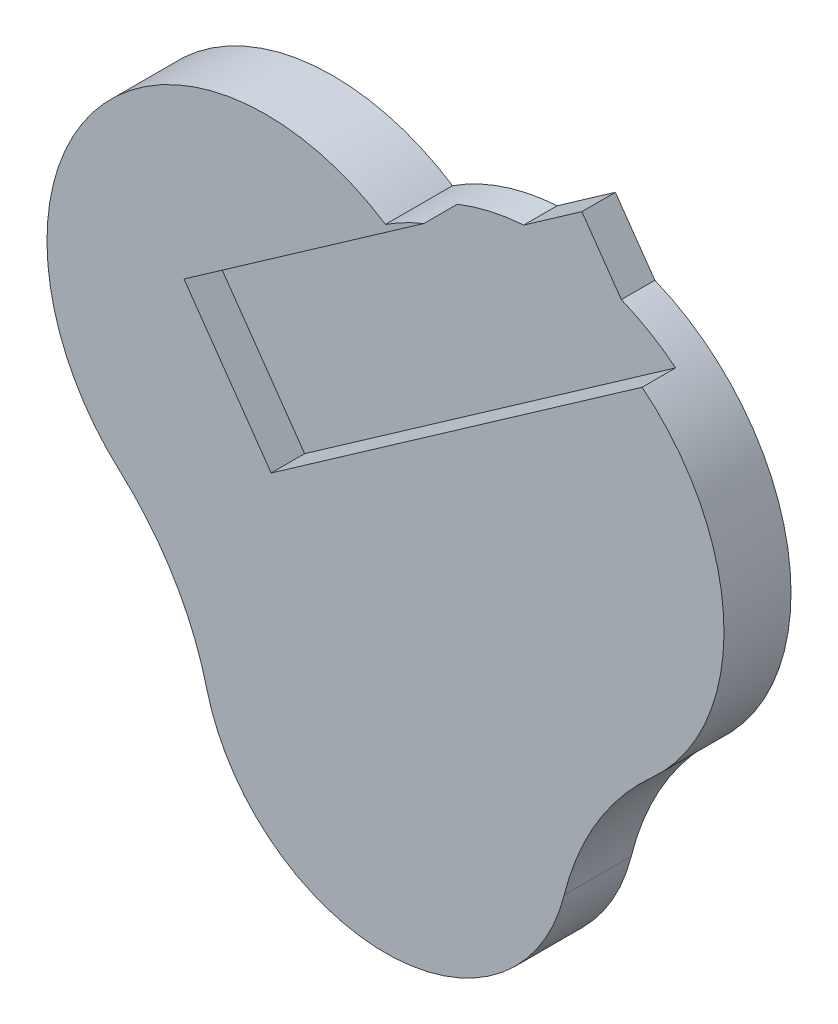
ISO-10303-21;
HEADER;
FILE_DESCRIPTION(('STEP AP214'),'2;1');
FILE_NAME('part.step','',(''),(''),'','','');
FILE_SCHEMA(('AUTOMOTIVE_DESIGN { 1 0 10303 214 1 1 1 1 }'));
ENDSEC;
DATA;
#1=APPLICATION_CONTEXT('core data for automotive mechanical design processes');
#2=APPLICATION_PROTOCOL_DEFINITION('international standard','automotive_design',2000,#1);
#3=PRODUCT_CONTEXT('',#1,'mechanical');
#4=PRODUCT('Part','Part','',(#3));
#5=PRODUCT_RELATED_PRODUCT_CATEGORY('part','',(#4));
#6=PRODUCT_DEFINITION_FORMATION('','',#4);
#7=PRODUCT_DEFINITION_CONTEXT('part definition',#1,'design');
#8=PRODUCT_DEFINITION('design','',#6,#7);
#9=PRODUCT_DEFINITION_SHAPE('','',#8);
#10=(LENGTH_UNIT() NAMED_UNIT(*) SI_UNIT(.MILLI.,.METRE.));
#11=(NAMED_UNIT(*) PLANE_ANGLE_UNIT() SI_UNIT($,.RADIAN.));
#12=(NAMED_UNIT(*) SI_UNIT($,.STERADIAN.) SOLID_ANGLE_UNIT());
#13=UNCERTAINTY_MEASURE_WITH_UNIT(LENGTH_MEASURE(1.E-05),#10,'distance_accuracy_value','');
#14=(GEOMETRIC_REPRESENTATION_CONTEXT(3) GLOBAL_UNCERTAINTY_ASSIGNED_CONTEXT((#13)) GLOBAL_UNIT_ASSIGNED_CONTEXT((#10,
#11,#12)) REPRESENTATION_CONTEXT('',''));
#15=CARTESIAN_POINT('',(0.,0.,0.));
#16=DIRECTION('',(0.,0.,1.));
#17=DIRECTION('',(1.,0.,0.));
#18=AXIS2_PLACEMENT_3D('',#15,#16,#17);
#19=CARTESIAN_POINT('',(157.736806162143,175.053622582744,38.1));
#20=DIRECTION('',(0.,0.,-1.));
#21=DIRECTION('',(-1.,0.,0.));
#22=AXIS2_PLACEMENT_3D('',#19,#20,#21);
#23=CYLINDRICAL_SURFACE('',#22,124.445088450723);
#24=DIRECTION('',(0.,0.,-1.));
#25=VECTOR('',#24,1.);
#26=CARTESIAN_POINT('',(204.797309550195,290.257307681666,83.1657079248374));
#27=LINE('',#26,#25);
#28=CARTESIAN_POINT('',(204.797309550195,290.257307681666,19.05));
#29=VERTEX_POINT('',#28);
#30=CARTESIAN_POINT('',(204.797309550195,290.257307681666,0.));
#31=VERTEX_POINT('',#30);
#32=EDGE_CURVE('E134',#29,#31,#27,.T.);
#33=ORIENTED_EDGE('',*,*,#32,.F.);
#34=CARTESIAN_POINT('',(157.736806162143,175.053622582744,19.05));
#35=DIRECTION('',(0.,0.,-1.));
#36=DIRECTION('',(-1.,0.,0.));
#37=AXIS2_PLACEMENT_3D('',#34,#35,#36);
#38=CIRCLE('',#37,124.445088450723);
#39=CARTESIAN_POINT('',(235.653251342295,272.087676450429,19.05));
#40=VERTEX_POINT('',#39);
#41=EDGE_CURVE('E154',#29,#40,#38,.T.);
#42=ORIENTED_EDGE('',*,*,#41,.T.);
#43=DIRECTION('',(0.,0.,-1.));
#44=VECTOR('',#43,1.);
#45=CARTESIAN_POINT('',(235.653251342295,272.087676450429,38.1));
#46=LINE('',#45,#44);
#47=CARTESIAN_POINT('',(235.653251342295,272.087676450429,38.1));
#48=VERTEX_POINT('',#47);
#49=EDGE_CURVE('E208',#48,#40,#46,.T.);
#50=ORIENTED_EDGE('',*,*,#49,.F.);
#51=CARTESIAN_POINT('',(157.736806162143,175.053622582744,38.1));
#52=DIRECTION('',(0.,0.,1.));
#53=DIRECTION('',(1.,0.,0.));
#54=AXIS2_PLACEMENT_3D('',#51,#52,#53);
#55=CIRCLE('',#54,124.445088450723);
#56=CARTESIAN_POINT('',(240.963304038896,82.5337323391904,38.1));
#57=VERTEX_POINT('',#56);
#58=EDGE_CURVE('E177',#57,#48,#55,.T.);
#59=ORIENTED_EDGE('',*,*,#58,.F.);
#60=DIRECTION('',(0.,0.,-1.));
#61=VECTOR('',#60,1.);
#62=CARTESIAN_POINT('',(240.963304038896,82.5337323391904,38.1));
#63=LINE('',#62,#61);
#64=CARTESIAN_POINT('',(240.963304038896,82.5337323391904,0.));
#65=VERTEX_POINT('',#64);
#66=EDGE_CURVE('E211',#57,#65,#63,.T.);
#67=ORIENTED_EDGE('',*,*,#66,.T.);
#68=CARTESIAN_POINT('',(157.736806162143,175.053622582744,0.));
#69=DIRECTION('',(0.,0.,1.));
#70=DIRECTION('',(1.,0.,0.));
#71=AXIS2_PLACEMENT_3D('',#68,#69,#70);
#72=CIRCLE('',#71,124.445088450723);
#73=EDGE_CURVE('E57',#65,#31,#72,.T.);
#74=ORIENTED_EDGE('',*,*,#73,.T.);
#75=EDGE_LOOP('',(#33,#42,#50,#59,#67,#74));
#76=FACE_BOUND('',#75,.T.);
#77=ADVANCED_FACE('F34',(#76),#23,.T.);
#78=DIRECTION('',(0.,0.,-1.));
#79=VECTOR('',#78,1.);
#80=CARTESIAN_POINT('',(149.289297510862,299.211665564643,83.1657079248374));
#81=LINE('',#80,#79);
#82=CARTESIAN_POINT('',(149.289297510862,299.211665564643,19.05));
#83=VERTEX_POINT('',#82);
#84=CARTESIAN_POINT('',(149.289297510862,299.211665564643,0.));
#85=VERTEX_POINT('',#84);
#86=EDGE_CURVE('E49',#83,#85,#81,.T.);
#87=ORIENTED_EDGE('',*,*,#86,.T.);
#88=CARTESIAN_POINT('',(89.7645171261392,279.295399057986,0.));
#89=VERTEX_POINT('',#88);
#90=EDGE_CURVE('E143',#85,#89,#72,.T.);
#91=ORIENTED_EDGE('',*,*,#90,.T.);
#92=DIRECTION('',(0.,0.,-1.));
#93=VECTOR('',#92,1.);
#94=CARTESIAN_POINT('',(89.7645171261392,279.295399057986,38.1));
#95=LINE('',#94,#93);
#96=CARTESIAN_POINT('',(89.7645171261392,279.295399057986,38.1));
#97=VERTEX_POINT('',#96);
#98=EDGE_CURVE('E11',#97,#89,#95,.T.);
#99=ORIENTED_EDGE('',*,*,#98,.F.);
#100=CARTESIAN_POINT('',(157.736806162143,175.053622582744,38.1));
#101=DIRECTION('',(0.,0.,1.));
#102=DIRECTION('',(1.,0.,0.));
#103=AXIS2_PLACEMENT_3D('',#100,#101,#102);
#104=CIRCLE('',#103,124.445088450723);
#105=CARTESIAN_POINT('',(111.532091006254,290.603197817236,38.1));
#106=VERTEX_POINT('',#105);
#107=EDGE_CURVE('E164',#106,#97,#104,.T.);
#108=ORIENTED_EDGE('',*,*,#107,.F.);
#109=DIRECTION('',(0.,0.,-1.));
#110=VECTOR('',#109,1.);
#111=CARTESIAN_POINT('',(111.532091006254,290.603197817236,38.1));
#112=LINE('',#111,#110);
#113=CARTESIAN_POINT('',(111.532091006254,290.603197817236,19.05));
#114=VERTEX_POINT('',#113);
#115=EDGE_CURVE('E187',#106,#114,#112,.T.);
#116=ORIENTED_EDGE('',*,*,#115,.T.);
#117=EDGE_CURVE('E155',#114,#83,#38,.T.);
#118=ORIENTED_EDGE('',*,*,#117,.T.);
#119=EDGE_LOOP('',(#87,#91,#99,#108,#116,#118));
#120=FACE_BOUND('',#119,.T.);
#121=ADVANCED_FACE('F235',(#120),#23,.T.);
#122=CARTESIAN_POINT('',(24.7670305216382,124.423554927247,38.1));
#123=DIRECTION('',(-0.573576436351047,0.819152044288991,0.));
#124=DIRECTION('',(-0.819152044288991,-0.573576436351047,0.));
#125=AXIS2_PLACEMENT_3D('',#122,#123,#124);
#126=PLANE('',#125);
#127=ORIENTED_EDGE('',*,*,#49,.T.);
#128=DIRECTION('',(-0.819152044288991,-0.573576436351047,0.));
#129=VECTOR('',#128,1.);
#130=CARTESIAN_POINT('',(24.7670305216382,124.423554927247,19.05));
#131=LINE('',#130,#129);
#132=CARTESIAN_POINT('',(24.7670305216382,124.423554927247,19.05));
#133=VERTEX_POINT('',#132);
#134=EDGE_CURVE('E157',#40,#133,#131,.T.);
#135=ORIENTED_EDGE('',*,*,#134,.T.);
#136=DIRECTION('',(0.,0.,-1.));
#137=VECTOR('',#136,1.);
#138=CARTESIAN_POINT('',(24.7670305216382,124.423554927247,38.1));
#139=LINE('',#138,#137);
#140=CARTESIAN_POINT('',(24.7670305216382,124.423554927247,38.1));
#141=VERTEX_POINT('',#140);
#142=EDGE_CURVE('E205',#141,#133,#139,.T.);
#143=ORIENTED_EDGE('',*,*,#142,.F.);
#144=DIRECTION('',(0.819152044288991,0.573576436351047,0.));
#145=VECTOR('',#144,1.);
#146=CARTESIAN_POINT('',(24.7670305216382,124.423554927247,38.1));
#147=LINE('',#146,#145);
#148=EDGE_CURVE('E179',#141,#48,#147,.T.);
#149=ORIENTED_EDGE('',*,*,#148,.T.);
#150=EDGE_LOOP('',(#127,#135,#143,#149));
#151=FACE_BOUND('',#150,.T.);
#152=ADVANCED_FACE('F237',(#151),#126,.T.);
#153=CARTESIAN_POINT('',(0.,159.794540199646,38.1));
#154=DIRECTION('',(-0.819152044288991,-0.573576436351047,0.));
#155=DIRECTION('',(0.573576436351047,-0.819152044288991,0.));
#156=AXIS2_PLACEMENT_3D('',#153,#154,#155);
#157=PLANE('',#156);
#158=DIRECTION('',(-0.573576436351047,0.819152044288991,0.));
#159=VECTOR('',#158,1.);
#160=CARTESIAN_POINT('',(-24.7670305216382,195.165525472045,19.05));
#161=LINE('',#160,#159);
#162=CARTESIAN_POINT('',(-24.7670305216382,195.165525472045,19.05));
#163=VERTEX_POINT('',#162);
#164=EDGE_CURVE('E160',#133,#163,#161,.T.);
#165=ORIENTED_EDGE('',*,*,#164,.T.);
#166=DIRECTION('',(0.,0.,-1.));
#167=VECTOR('',#166,1.);
#168=CARTESIAN_POINT('',(-24.7670305216382,195.165525472045,38.1));
#169=LINE('',#168,#167);
#170=CARTESIAN_POINT('',(-24.7670305216382,195.165525472045,38.1));
#171=VERTEX_POINT('',#170);
#172=EDGE_CURVE('E202',#171,#163,#169,.T.);
#173=ORIENTED_EDGE('',*,*,#172,.F.);
#174=DIRECTION('',(0.573576436351047,-0.819152044288991,0.));
#175=VECTOR('',#174,1.);
#176=CARTESIAN_POINT('',(0.,159.794540199646,38.1));
#177=LINE('',#176,#175);
#178=EDGE_CURVE('E182',#171,#141,#177,.T.);
#179=ORIENTED_EDGE('',*,*,#178,.T.);
#180=ORIENTED_EDGE('',*,*,#142,.T.);
#181=EDGE_LOOP('',(#165,#173,#179,#180));
#182=FACE_BOUND('',#181,.T.);
#183=ADVANCED_FACE('F243',(#182),#157,.F.);
#184=CARTESIAN_POINT('',(-24.7670305216382,195.165525472045,38.1));
#185=DIRECTION('',(-0.573576436351047,0.819152044288991,0.));
#186=DIRECTION('',(-0.819152044288991,-0.573576436351047,0.));
#187=AXIS2_PLACEMENT_3D('',#184,#185,#186);
#188=PLANE('',#187);
#189=DIRECTION('',(0.819152044288991,0.573576436351047,0.));
#190=VECTOR('',#189,1.);
#191=CARTESIAN_POINT('',(111.532091006254,290.603197817236,19.05));
#192=LINE('',#191,#190);
#193=EDGE_CURVE('E151',#163,#114,#192,.T.);
#194=ORIENTED_EDGE('',*,*,#193,.T.);
#195=ORIENTED_EDGE('',*,*,#115,.F.);
#196=DIRECTION('',(0.819152044288991,0.573576436351047,0.));
#197=VECTOR('',#196,1.);
#198=CARTESIAN_POINT('',(-24.7670305216382,195.165525472045,38.1));
#199=LINE('',#198,#197);
#200=EDGE_CURVE('E185',#171,#106,#199,.T.);
#201=ORIENTED_EDGE('',*,*,#200,.F.);
#202=ORIENTED_EDGE('',*,*,#172,.T.);
#203=EDGE_LOOP('',(#194,#195,#201,#202));
#204=FACE_BOUND('',#203,.T.);
#205=ADVANCED_FACE('F257',(#204),#188,.F.);
#206=CARTESIAN_POINT('',(21.7922280901354,175.053622582744,38.1));
#207=DIRECTION('',(0.,0.,-1.));
#208=DIRECTION('',(-1.,0.,0.));
#209=AXIS2_PLACEMENT_3D('',#206,#207,#208);
#210=CYLINDRICAL_SURFACE('',#209,124.445088450723);
#211=CARTESIAN_POINT('',(21.7922280901354,175.053622582744,0.));
#212=DIRECTION('',(0.,0.,1.));
#213=DIRECTION('',(1.,0.,0.));
#214=AXIS2_PLACEMENT_3D('',#211,#212,#213);
#215=CIRCLE('',#214,124.445088450723);
#216=CARTESIAN_POINT('',(-61.4342697866172,82.5337323391905,0.));
#217=VERTEX_POINT('',#216);
#218=EDGE_CURVE('E163',#89,#217,#215,.T.);
#219=ORIENTED_EDGE('',*,*,#218,.T.);
#220=DIRECTION('',(0.,0.,-1.));
#221=VECTOR('',#220,1.);
#222=CARTESIAN_POINT('',(-61.4342697866172,82.5337323391905,38.1));
#223=LINE('',#222,#221);
#224=CARTESIAN_POINT('',(-61.4342697866172,82.5337323391905,38.1));
#225=VERTEX_POINT('',#224);
#226=EDGE_CURVE('E42',#225,#217,#223,.T.);
#227=ORIENTED_EDGE('',*,*,#226,.F.);
#228=CARTESIAN_POINT('',(21.7922280901354,175.053622582744,38.1));
#229=DIRECTION('',(0.,0.,1.));
#230=DIRECTION('',(1.,0.,0.));
#231=AXIS2_PLACEMENT_3D('',#228,#229,#230);
#232=CIRCLE('',#231,124.445088450723);
#233=EDGE_CURVE('E167',#97,#225,#232,.T.);
#234=ORIENTED_EDGE('',*,*,#233,.F.);
#235=ORIENTED_EDGE('',*,*,#98,.T.);
#236=EDGE_LOOP('',(#219,#227,#234,#235));
#237=FACE_BOUND('',#236,.T.);
#238=ADVANCED_FACE('F36',(#237),#210,.T.);
#239=CARTESIAN_POINT('',(-171.418147213788,-39.7313698544781,38.1));
#240=DIRECTION('',(0.,0.,-1.));
#241=DIRECTION('',(-1.,0.,0.));
#242=AXIS2_PLACEMENT_3D('',#239,#240,#241);
#243=CYLINDRICAL_SURFACE('',#242,164.454274825384);
#244=CARTESIAN_POINT('',(-171.418147213788,-39.7313698544781,0.));
#245=DIRECTION('',(0.,0.,1.));
#246=DIRECTION('',(1.,0.,0.));
#247=AXIS2_PLACEMENT_3D('',#244,#245,#246);
#248=CIRCLE('',#247,164.454274825384);
#249=CARTESIAN_POINT('',(-11.8354828738608,0.,0.));
#250=VERTEX_POINT('',#249);
#251=EDGE_CURVE('E190',#250,#217,#248,.T.);
#252=ORIENTED_EDGE('',*,*,#251,.F.);
#253=DIRECTION('',(0.,0.,-1.));
#254=VECTOR('',#253,1.);
#255=CARTESIAN_POINT('',(-11.8354828738608,0.,38.1));
#256=LINE('',#255,#254);
#257=CARTESIAN_POINT('',(-11.8354828738608,0.,38.1));
#258=VERTEX_POINT('',#257);
#259=EDGE_CURVE('E215',#258,#250,#256,.T.);
#260=ORIENTED_EDGE('',*,*,#259,.F.);
#261=CARTESIAN_POINT('',(-171.418147213788,-39.7313698544781,38.1));
#262=DIRECTION('',(0.,0.,1.));
#263=DIRECTION('',(1.,0.,0.));
#264=AXIS2_PLACEMENT_3D('',#261,#262,#263);
#265=CIRCLE('',#264,164.454274825384);
#266=EDGE_CURVE('E169',#258,#225,#265,.T.);
#267=ORIENTED_EDGE('',*,*,#266,.T.);
#268=ORIENTED_EDGE('',*,*,#226,.T.);
#269=EDGE_LOOP('',(#252,#260,#267,#268));
#270=FACE_BOUND('',#269,.T.);
#271=ADVANCED_FACE('F219',(#270),#243,.F.);
#272=CARTESIAN_POINT('',(89.7645171261392,25.2953990579862,38.1));
#273=DIRECTION('',(0.,0.,-1.));
#274=DIRECTION('',(-1.,0.,0.));
#275=AXIS2_PLACEMENT_3D('',#272,#273,#274);
#276=CYLINDRICAL_SURFACE('',#275,104.701562612517);
#277=CARTESIAN_POINT('',(89.7645171261392,25.2953990579862,0.));
#278=DIRECTION('',(0.,0.,1.));
#279=DIRECTION('',(1.,0.,0.));
#280=AXIS2_PLACEMENT_3D('',#277,#278,#279);
#281=CIRCLE('',#280,104.701562612517);
#282=CARTESIAN_POINT('',(191.364517126139,0.,0.));
#283=VERTEX_POINT('',#282);
#284=EDGE_CURVE('E193',#250,#283,#281,.T.);
#285=ORIENTED_EDGE('',*,*,#284,.T.);
#286=DIRECTION('',(0.,0.,-1.));
#287=VECTOR('',#286,1.);
#288=CARTESIAN_POINT('',(191.364517126139,0.,38.1));
#289=LINE('',#288,#287);
#290=CARTESIAN_POINT('',(191.364517126139,0.,38.1));
#291=VERTEX_POINT('',#290);
#292=EDGE_CURVE('E213',#291,#283,#289,.T.);
#293=ORIENTED_EDGE('',*,*,#292,.F.);
#294=CARTESIAN_POINT('',(89.7645171261392,25.2953990579862,38.1));
#295=DIRECTION('',(0.,0.,1.));
#296=DIRECTION('',(1.,0.,0.));
#297=AXIS2_PLACEMENT_3D('',#294,#295,#296);
#298=CIRCLE('',#297,104.701562612517);
#299=EDGE_CURVE('E172',#258,#291,#298,.T.);
#300=ORIENTED_EDGE('',*,*,#299,.F.);
#301=ORIENTED_EDGE('',*,*,#259,.T.);
#302=EDGE_LOOP('',(#285,#293,#300,#301));
#303=FACE_BOUND('',#302,.T.);
#304=ADVANCED_FACE('F227',(#303),#276,.T.);
#305=CARTESIAN_POINT('',(350.947181466069,-39.7313698544808,38.1));
#306=DIRECTION('',(0.,0.,-1.));
#307=DIRECTION('',(-1.,0.,0.));
#308=AXIS2_PLACEMENT_3D('',#305,#306,#307);
#309=CYLINDRICAL_SURFACE('',#308,164.454274825388);
#310=CARTESIAN_POINT('',(350.947181466069,-39.7313698544808,0.));
#311=DIRECTION('',(0.,0.,1.));
#312=DIRECTION('',(1.,0.,0.));
#313=AXIS2_PLACEMENT_3D('',#310,#311,#312);
#314=CIRCLE('',#313,164.454274825388);
#315=EDGE_CURVE('E196',#65,#283,#314,.T.);
#316=ORIENTED_EDGE('',*,*,#315,.F.);
#317=ORIENTED_EDGE('',*,*,#66,.F.);
#318=CARTESIAN_POINT('',(350.947181466069,-39.7313698544808,38.1));
#319=DIRECTION('',(0.,0.,1.));
#320=DIRECTION('',(1.,0.,0.));
#321=AXIS2_PLACEMENT_3D('',#318,#319,#320);
#322=CIRCLE('',#321,164.454274825388);
#323=EDGE_CURVE('E174',#57,#291,#322,.T.);
#324=ORIENTED_EDGE('',*,*,#323,.T.);
#325=ORIENTED_EDGE('',*,*,#292,.T.);
#326=EDGE_LOOP('',(#316,#317,#324,#325));
#327=FACE_BOUND('',#326,.T.);
#328=ADVANCED_FACE('F248',(#327),#309,.F.);
#329=CARTESIAN_POINT('',(157.736806162143,175.053622582744,38.1));
#330=DIRECTION('',(0.,0.,1.));
#331=DIRECTION('',(1.,0.,0.));
#332=AXIS2_PLACEMENT_3D('',#329,#330,#331);
#333=PLANE('',#332);
#334=ORIENTED_EDGE('',*,*,#107,.T.);
#335=ORIENTED_EDGE('',*,*,#233,.T.);
#336=ORIENTED_EDGE('',*,*,#266,.F.);
#337=ORIENTED_EDGE('',*,*,#299,.T.);
#338=ORIENTED_EDGE('',*,*,#323,.F.);
#339=ORIENTED_EDGE('',*,*,#58,.T.);
#340=ORIENTED_EDGE('',*,*,#148,.F.);
#341=ORIENTED_EDGE('',*,*,#178,.F.);
#342=ORIENTED_EDGE('',*,*,#200,.T.);
#343=EDGE_LOOP('',(#334,#335,#336,#337,#338,#339,#340,#341,#342));
#344=FACE_BOUND('',#343,.T.);
#345=ADVANCED_FACE('F231',(#344),#333,.T.);
#346=CARTESIAN_POINT('',(157.736806162143,175.053622582744,0.));
#347=DIRECTION('',(0.,0.,1.));
#348=DIRECTION('',(1.,0.,0.));
#349=AXIS2_PLACEMENT_3D('',#346,#347,#348);
#350=PLANE('',#349);
#351=ORIENTED_EDGE('',*,*,#218,.F.);
#352=ORIENTED_EDGE('',*,*,#90,.F.);
#353=DIRECTION('',(-0.819152044288991,-0.573576436351047,0.));
#354=VECTOR('',#353,1.);
#355=CARTESIAN_POINT('',(-91.4688218024735,130.631015536252,0.));
#356=LINE('',#355,#354);
#357=CARTESIAN_POINT('',(182.328560633982,322.346006660345,0.));
#358=VERTEX_POINT('',#357);
#359=EDGE_CURVE('E129',#358,#85,#356,.T.);
#360=ORIENTED_EDGE('',*,*,#359,.F.);
#361=DIRECTION('',(-0.573576436351048,0.81915204428899,0.));
#362=VECTOR('',#361,1.);
#363=CARTESIAN_POINT('',(273.797382436455,191.714991124094,0.));
#364=LINE('',#363,#362);
#365=EDGE_CURVE('E135',#31,#358,#364,.T.);
#366=ORIENTED_EDGE('',*,*,#365,.F.);
#367=ORIENTED_EDGE('',*,*,#73,.F.);
#368=ORIENTED_EDGE('',*,*,#315,.T.);
#369=ORIENTED_EDGE('',*,*,#284,.F.);
#370=ORIENTED_EDGE('',*,*,#251,.T.);
#371=EDGE_LOOP('',(#351,#352,#360,#366,#367,#368,#369,#370));
#372=FACE_BOUND('',#371,.T.);
#373=ADVANCED_FACE('F142',(#372),#350,.F.);
#374=CARTESIAN_POINT('',(157.736806162143,175.053622582744,19.05));
#375=DIRECTION('',(0.,0.,-1.));
#376=DIRECTION('',(-1.,0.,0.));
#377=AXIS2_PLACEMENT_3D('',#374,#375,#376);
#378=PLANE('',#377);
#379=ORIENTED_EDGE('',*,*,#193,.F.);
#380=ORIENTED_EDGE('',*,*,#164,.F.);
#381=ORIENTED_EDGE('',*,*,#134,.F.);
#382=ORIENTED_EDGE('',*,*,#41,.F.);
#383=DIRECTION('',(0.573576436351048,-0.81915204428899,0.));
#384=VECTOR('',#383,1.);
#385=CARTESIAN_POINT('',(273.797382436455,191.714991124094,19.05));
#386=LINE('',#385,#384);
#387=CARTESIAN_POINT('',(182.328560633982,322.346006660345,19.05));
#388=VERTEX_POINT('',#387);
#389=EDGE_CURVE('E148',#388,#29,#386,.T.);
#390=ORIENTED_EDGE('',*,*,#389,.F.);
#391=DIRECTION('',(0.819152044288991,0.573576436351047,0.));
#392=VECTOR('',#391,1.);
#393=CARTESIAN_POINT('',(-91.4688218024735,130.631015536252,19.05));
#394=LINE('',#393,#392);
#395=EDGE_CURVE('E131',#83,#388,#394,.T.);
#396=ORIENTED_EDGE('',*,*,#395,.F.);
#397=ORIENTED_EDGE('',*,*,#117,.F.);
#398=EDGE_LOOP('',(#379,#380,#381,#382,#390,#396,#397));
#399=FACE_BOUND('',#398,.T.);
#400=ADVANCED_FACE('F270',(#399),#378,.F.);
#401=CARTESIAN_POINT('',(273.797382436455,191.714991124094,83.1657079248374));
#402=DIRECTION('',(-0.81915204428899,-0.573576436351048,0.));
#403=DIRECTION('',(0.573576436351048,-0.81915204428899,0.));
#404=AXIS2_PLACEMENT_3D('',#401,#402,#403);
#405=PLANE('',#404);
#406=DIRECTION('',(0.,0.,-1.));
#407=VECTOR('',#406,1.);
#408=CARTESIAN_POINT('',(182.328560633982,322.346006660345,83.1657079248374));
#409=LINE('',#408,#407);
#410=EDGE_CURVE('E125',#388,#358,#409,.T.);
#411=ORIENTED_EDGE('',*,*,#410,.F.);
#412=ORIENTED_EDGE('',*,*,#389,.T.);
#413=ORIENTED_EDGE('',*,*,#32,.T.);
#414=ORIENTED_EDGE('',*,*,#365,.T.);
#415=EDGE_LOOP('',(#411,#412,#413,#414));
#416=FACE_BOUND('',#415,.T.);
#417=ADVANCED_FACE('F138',(#416),#405,.F.);
#418=CARTESIAN_POINT('',(-91.4688218024735,130.631015536252,83.1657079248374));
#419=DIRECTION('',(0.573576436351047,-0.819152044288991,0.));
#420=DIRECTION('',(0.819152044288991,0.573576436351047,0.));
#421=AXIS2_PLACEMENT_3D('',#418,#419,#420);
#422=PLANE('',#421);
#423=ORIENTED_EDGE('',*,*,#86,.F.);
#424=ORIENTED_EDGE('',*,*,#395,.T.);
#425=ORIENTED_EDGE('',*,*,#410,.T.);
#426=ORIENTED_EDGE('',*,*,#359,.T.);
#427=EDGE_LOOP('',(#423,#424,#425,#426));
#428=FACE_BOUND('',#427,.T.);
#429=ADVANCED_FACE('F127',(#428),#422,.F.);
#430=CLOSED_SHELL('',(#77,#121,#152,#183,#205,#238,#271,#304,#328,#345,#373,#400,#417,#429));
#431=MANIFOLD_SOLID_BREP('B2',#430);
#432=ADVANCED_BREP_SHAPE_REPRESENTATION('',(#18,#431),#14);
#433=SHAPE_DEFINITION_REPRESENTATION(#9,#432);
ENDSEC;
END-ISO-10303-21;
